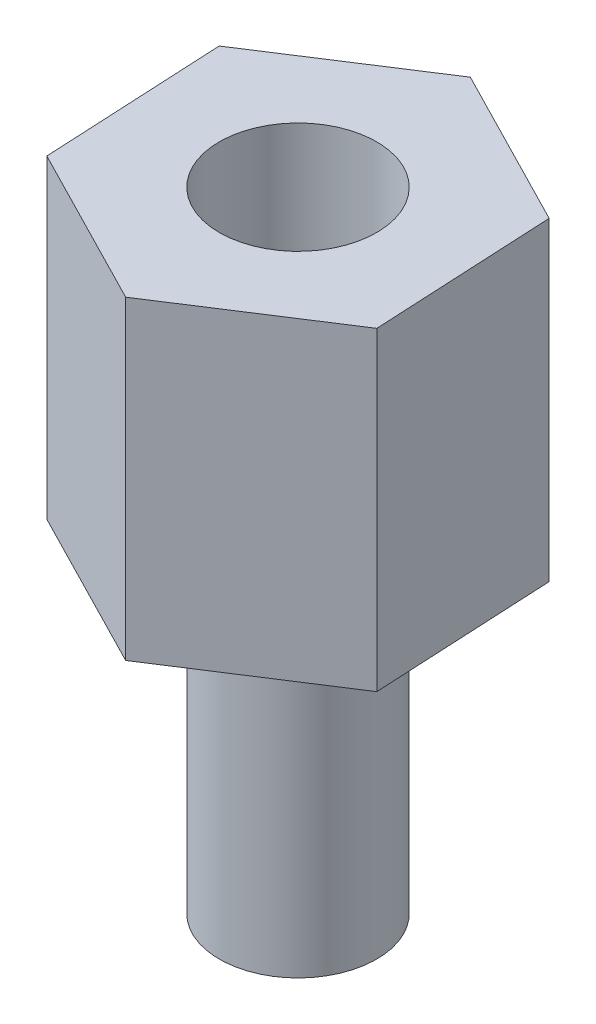
ISO-10303-21;
HEADER;
FILE_DESCRIPTION(('STEP AP214'),'2;1');
FILE_NAME('part.step','',(''),(''),'','','');
FILE_SCHEMA(('AUTOMOTIVE_DESIGN { 1 0 10303 214 1 1 1 1 }'));
ENDSEC;
DATA;
#1=APPLICATION_CONTEXT('core data for automotive mechanical design processes');
#2=APPLICATION_PROTOCOL_DEFINITION('international standard','automotive_design',2000,#1);
#3=PRODUCT_CONTEXT('',#1,'mechanical');
#4=PRODUCT('Part','Part','',(#3));
#5=PRODUCT_RELATED_PRODUCT_CATEGORY('part','',(#4));
#6=PRODUCT_DEFINITION_FORMATION('','',#4);
#7=PRODUCT_DEFINITION_CONTEXT('part definition',#1,'design');
#8=PRODUCT_DEFINITION('design','',#6,#7);
#9=PRODUCT_DEFINITION_SHAPE('','',#8);
#10=(LENGTH_UNIT() NAMED_UNIT(*) SI_UNIT(.MILLI.,.METRE.));
#11=(NAMED_UNIT(*) PLANE_ANGLE_UNIT() SI_UNIT($,.RADIAN.));
#12=(NAMED_UNIT(*) SI_UNIT($,.STERADIAN.) SOLID_ANGLE_UNIT());
#13=UNCERTAINTY_MEASURE_WITH_UNIT(LENGTH_MEASURE(1.E-05),#10,'distance_accuracy_value','');
#14=(GEOMETRIC_REPRESENTATION_CONTEXT(3) GLOBAL_UNCERTAINTY_ASSIGNED_CONTEXT((#13)) GLOBAL_UNIT_ASSIGNED_CONTEXT((#10,
#11,#12)) REPRESENTATION_CONTEXT('',''));
#15=CARTESIAN_POINT('',(0.,0.,0.));
#16=DIRECTION('',(0.,0.,1.));
#17=DIRECTION('',(1.,0.,0.));
#18=AXIS2_PLACEMENT_3D('',#15,#16,#17);
#19=CARTESIAN_POINT('',(2.56910375112783,0.,1.31644948603212));
#20=DIRECTION('',(0.,-1.,0.));
#21=DIRECTION('',(0.,0.,-1.));
#22=AXIS2_PLACEMENT_3D('',#19,#20,#21);
#23=PLANE('',#22);
#24=DIRECTION('',(-0.0500469768772833,0.,-0.998746864878907));
#25=VECTOR('',#24,1.);
#26=CARTESIAN_POINT('',(2.56910375112783,0.,1.31644948603212));
#27=LINE('',#26,#25);
#28=CARTESIAN_POINT('',(2.56910375112783,0.,1.31644948603212));
#29=VERTEX_POINT('',#28);
#30=CARTESIAN_POINT('',(2.4246305732667,0.,-1.56668437041854));
#31=VERTEX_POINT('',#30);
#32=EDGE_CURVE('E89',#29,#31,#27,.T.);
#33=ORIENTED_EDGE('',*,*,#32,.F.);
#34=DIRECTION('',(0.839916668496556,0.,-0.542715385797793));
#35=VECTOR('',#34,1.);
#36=CARTESIAN_POINT('',(0.144473177861132,0.,2.88313385645066));
#37=LINE('',#36,#35);
#38=CARTESIAN_POINT('',(0.144473177861132,0.,2.88313385645066));
#39=VERTEX_POINT('',#38);
#40=EDGE_CURVE('E115',#39,#29,#37,.T.);
#41=ORIENTED_EDGE('',*,*,#40,.F.);
#42=DIRECTION('',(0.889963645373839,0.,0.456031479081114));
#43=VECTOR('',#42,1.);
#44=CARTESIAN_POINT('',(-2.4246305732667,0.,1.56668437041854));
#45=LINE('',#44,#43);
#46=CARTESIAN_POINT('',(-2.4246305732667,0.,1.56668437041854));
#47=VERTEX_POINT('',#46);
#48=EDGE_CURVE('E113',#47,#39,#45,.T.);
#49=ORIENTED_EDGE('',*,*,#48,.F.);
#50=DIRECTION('',(0.0500469768772832,0.,0.998746864878907));
#51=VECTOR('',#50,1.);
#52=CARTESIAN_POINT('',(-2.56910375112783,0.,-1.31644948603212));
#53=LINE('',#52,#51);
#54=CARTESIAN_POINT('',(-2.56910375112783,0.,-1.31644948603212));
#55=VERTEX_POINT('',#54);
#56=EDGE_CURVE('E111',#55,#47,#53,.T.);
#57=ORIENTED_EDGE('',*,*,#56,.F.);
#58=DIRECTION('',(-0.839916668496555,0.,0.542715385797793));
#59=VECTOR('',#58,1.);
#60=CARTESIAN_POINT('',(-0.144473177861132,0.,-2.88313385645066));
#61=LINE('',#60,#59);
#62=CARTESIAN_POINT('',(-0.144473177861132,0.,-2.88313385645066));
#63=VERTEX_POINT('',#62);
#64=EDGE_CURVE('E91',#63,#55,#61,.T.);
#65=ORIENTED_EDGE('',*,*,#64,.F.);
#66=DIRECTION('',(-0.889963645373839,0.,-0.456031479081114));
#67=VECTOR('',#66,1.);
#68=CARTESIAN_POINT('',(2.4246305732667,0.,-1.56668437041854));
#69=LINE('',#68,#67);
#70=EDGE_CURVE('E85',#31,#63,#69,.T.);
#71=ORIENTED_EDGE('',*,*,#70,.F.);
#72=EDGE_LOOP('',(#33,#41,#49,#57,#65,#71));
#73=FACE_BOUND('',#72,.T.);
#74=CARTESIAN_POINT('',(0.,0.,0.));
#75=DIRECTION('',(0.,-1.,0.));
#76=DIRECTION('',(0.,0.,-1.));
#77=AXIS2_PLACEMENT_3D('',#74,#75,#76);
#78=CIRCLE('',#77,1.25);
#79=CARTESIAN_POINT('',(0.,0.,-1.25));
#80=VERTEX_POINT('',#79);
#81=EDGE_CURVE('E106',#80,#80,#78,.T.);
#82=ORIENTED_EDGE('',*,*,#81,.F.);
#83=EDGE_LOOP('',(#82));
#84=FACE_BOUND('',#83,.T.);
#85=ADVANCED_FACE('F32',(#73,#84),#23,.T.);
#86=CARTESIAN_POINT('',(2.56910375112783,5.,1.31644948603212));
#87=DIRECTION('',(-0.998746864878907,0.,0.0500469768772833));
#88=DIRECTION('',(0.0500469768772833,0.,0.998746864878907));
#89=AXIS2_PLACEMENT_3D('',#86,#87,#88);
#90=PLANE('',#89);
#91=ORIENTED_EDGE('',*,*,#32,.T.);
#92=DIRECTION('',(0.,-1.,0.));
#93=VECTOR('',#92,1.);
#94=CARTESIAN_POINT('',(2.4246305732667,5.,-1.56668437041854));
#95=LINE('',#94,#93);
#96=CARTESIAN_POINT('',(2.4246305732667,5.,-1.56668437041854));
#97=VERTEX_POINT('',#96);
#98=EDGE_CURVE('E11',#97,#31,#95,.T.);
#99=ORIENTED_EDGE('',*,*,#98,.F.);
#100=DIRECTION('',(-0.0500469768772833,0.,-0.998746864878907));
#101=VECTOR('',#100,1.);
#102=CARTESIAN_POINT('',(2.56910375112783,5.,1.31644948603212));
#103=LINE('',#102,#101);
#104=CARTESIAN_POINT('',(2.56910375112783,5.,1.31644948603212));
#105=VERTEX_POINT('',#104);
#106=EDGE_CURVE('E117',#105,#97,#103,.T.);
#107=ORIENTED_EDGE('',*,*,#106,.F.);
#108=DIRECTION('',(0.,-1.,0.));
#109=VECTOR('',#108,1.);
#110=CARTESIAN_POINT('',(2.56910375112783,5.,1.31644948603212));
#111=LINE('',#110,#109);
#112=EDGE_CURVE('E102',#105,#29,#111,.T.);
#113=ORIENTED_EDGE('',*,*,#112,.T.);
#114=EDGE_LOOP('',(#91,#99,#107,#113));
#115=FACE_BOUND('',#114,.T.);
#116=ADVANCED_FACE('F34',(#115),#90,.F.);
#117=CARTESIAN_POINT('',(2.4246305732667,5.,-1.56668437041854));
#118=DIRECTION('',(-0.456031479081114,0.,0.889963645373839));
#119=DIRECTION('',(0.889963645373839,0.,0.456031479081114));
#120=AXIS2_PLACEMENT_3D('',#117,#118,#119);
#121=PLANE('',#120);
#122=ORIENTED_EDGE('',*,*,#70,.T.);
#123=DIRECTION('',(0.,-1.,0.));
#124=VECTOR('',#123,1.);
#125=CARTESIAN_POINT('',(-0.144473177861132,5.,-2.88313385645066));
#126=LINE('',#125,#124);
#127=CARTESIAN_POINT('',(-0.144473177861132,5.,-2.88313385645066));
#128=VERTEX_POINT('',#127);
#129=EDGE_CURVE('E40',#128,#63,#126,.T.);
#130=ORIENTED_EDGE('',*,*,#129,.F.);
#131=DIRECTION('',(-0.889963645373839,0.,-0.456031479081114));
#132=VECTOR('',#131,1.);
#133=CARTESIAN_POINT('',(2.4246305732667,5.,-1.56668437041854));
#134=LINE('',#133,#132);
#135=EDGE_CURVE('E98',#97,#128,#134,.T.);
#136=ORIENTED_EDGE('',*,*,#135,.F.);
#137=ORIENTED_EDGE('',*,*,#98,.T.);
#138=EDGE_LOOP('',(#122,#130,#136,#137));
#139=FACE_BOUND('',#138,.T.);
#140=ADVANCED_FACE('F97',(#139),#121,.F.);
#141=CARTESIAN_POINT('',(-0.144473177861132,5.,-2.88313385645066));
#142=DIRECTION('',(0.542715385797793,0.,0.839916668496556));
#143=DIRECTION('',(0.839916668496556,0.,-0.542715385797793));
#144=AXIS2_PLACEMENT_3D('',#141,#142,#143);
#145=PLANE('',#144);
#146=ORIENTED_EDGE('',*,*,#64,.T.);
#147=DIRECTION('',(0.,-1.,0.));
#148=VECTOR('',#147,1.);
#149=CARTESIAN_POINT('',(-2.56910375112783,5.,-1.31644948603212));
#150=LINE('',#149,#148);
#151=CARTESIAN_POINT('',(-2.56910375112783,5.,-1.31644948603212));
#152=VERTEX_POINT('',#151);
#153=EDGE_CURVE('E133',#152,#55,#150,.T.);
#154=ORIENTED_EDGE('',*,*,#153,.F.);
#155=DIRECTION('',(-0.839916668496555,0.,0.542715385797793));
#156=VECTOR('',#155,1.);
#157=CARTESIAN_POINT('',(-0.144473177861132,5.,-2.88313385645066));
#158=LINE('',#157,#156);
#159=EDGE_CURVE('E120',#128,#152,#158,.T.);
#160=ORIENTED_EDGE('',*,*,#159,.F.);
#161=ORIENTED_EDGE('',*,*,#129,.T.);
#162=EDGE_LOOP('',(#146,#154,#160,#161));
#163=FACE_BOUND('',#162,.T.);
#164=ADVANCED_FACE('F137',(#163),#145,.F.);
#165=CARTESIAN_POINT('',(-2.56910375112783,5.,-1.31644948603212));
#166=DIRECTION('',(0.998746864878907,0.,-0.0500469768772832));
#167=DIRECTION('',(-0.0500469768772832,0.,-0.998746864878907));
#168=AXIS2_PLACEMENT_3D('',#165,#166,#167);
#169=PLANE('',#168);
#170=ORIENTED_EDGE('',*,*,#56,.T.);
#171=DIRECTION('',(0.,-1.,0.));
#172=VECTOR('',#171,1.);
#173=CARTESIAN_POINT('',(-2.4246305732667,5.,1.56668437041854));
#174=LINE('',#173,#172);
#175=CARTESIAN_POINT('',(-2.4246305732667,5.,1.56668437041854));
#176=VERTEX_POINT('',#175);
#177=EDGE_CURVE('E130',#176,#47,#174,.T.);
#178=ORIENTED_EDGE('',*,*,#177,.F.);
#179=DIRECTION('',(0.0500469768772832,0.,0.998746864878907));
#180=VECTOR('',#179,1.);
#181=CARTESIAN_POINT('',(-2.56910375112783,5.,-1.31644948603212));
#182=LINE('',#181,#180);
#183=EDGE_CURVE('E122',#152,#176,#182,.T.);
#184=ORIENTED_EDGE('',*,*,#183,.F.);
#185=ORIENTED_EDGE('',*,*,#153,.T.);
#186=EDGE_LOOP('',(#170,#178,#184,#185));
#187=FACE_BOUND('',#186,.T.);
#188=ADVANCED_FACE('F143',(#187),#169,.F.);
#189=CARTESIAN_POINT('',(-2.4246305732667,5.,1.56668437041854));
#190=DIRECTION('',(0.456031479081114,0.,-0.889963645373839));
#191=DIRECTION('',(-0.889963645373839,0.,-0.456031479081114));
#192=AXIS2_PLACEMENT_3D('',#189,#190,#191);
#193=PLANE('',#192);
#194=ORIENTED_EDGE('',*,*,#48,.T.);
#195=DIRECTION('',(0.,-1.,0.));
#196=VECTOR('',#195,1.);
#197=CARTESIAN_POINT('',(0.144473177861132,5.,2.88313385645066));
#198=LINE('',#197,#196);
#199=CARTESIAN_POINT('',(0.144473177861132,5.,2.88313385645066));
#200=VERTEX_POINT('',#199);
#201=EDGE_CURVE('E127',#200,#39,#198,.T.);
#202=ORIENTED_EDGE('',*,*,#201,.F.);
#203=DIRECTION('',(0.889963645373839,0.,0.456031479081114));
#204=VECTOR('',#203,1.);
#205=CARTESIAN_POINT('',(-2.4246305732667,5.,1.56668437041854));
#206=LINE('',#205,#204);
#207=EDGE_CURVE('E52',#176,#200,#206,.T.);
#208=ORIENTED_EDGE('',*,*,#207,.F.);
#209=ORIENTED_EDGE('',*,*,#177,.T.);
#210=EDGE_LOOP('',(#194,#202,#208,#209));
#211=FACE_BOUND('',#210,.T.);
#212=ADVANCED_FACE('F146',(#211),#193,.F.);
#213=CARTESIAN_POINT('',(0.144473177861132,5.,2.88313385645066));
#214=DIRECTION('',(-0.542715385797793,0.,-0.839916668496556));
#215=DIRECTION('',(-0.839916668496556,0.,0.542715385797793));
#216=AXIS2_PLACEMENT_3D('',#213,#214,#215);
#217=PLANE('',#216);
#218=ORIENTED_EDGE('',*,*,#40,.T.);
#219=ORIENTED_EDGE('',*,*,#112,.F.);
#220=DIRECTION('',(0.839916668496556,0.,-0.542715385797793));
#221=VECTOR('',#220,1.);
#222=CARTESIAN_POINT('',(0.144473177861132,5.,2.88313385645066));
#223=LINE('',#222,#221);
#224=EDGE_CURVE('E47',#200,#105,#223,.T.);
#225=ORIENTED_EDGE('',*,*,#224,.F.);
#226=ORIENTED_EDGE('',*,*,#201,.T.);
#227=EDGE_LOOP('',(#218,#219,#225,#226));
#228=FACE_BOUND('',#227,.T.);
#229=ADVANCED_FACE('F148',(#228),#217,.F.);
#230=CARTESIAN_POINT('',(2.56910375112783,5.,1.31644948603212));
#231=DIRECTION('',(0.,-1.,0.));
#232=DIRECTION('',(0.,0.,-1.));
#233=AXIS2_PLACEMENT_3D('',#230,#231,#232);
#234=PLANE('',#233);
#235=CARTESIAN_POINT('',(0.,5.,0.));
#236=DIRECTION('',(0.,1.,0.));
#237=DIRECTION('',(0.,0.,1.));
#238=AXIS2_PLACEMENT_3D('',#235,#236,#237);
#239=CIRCLE('',#238,1.25);
#240=CARTESIAN_POINT('',(0.,5.,1.25));
#241=VERTEX_POINT('',#240);
#242=EDGE_CURVE('E184',#241,#241,#239,.T.);
#243=ORIENTED_EDGE('',*,*,#242,.F.);
#244=EDGE_LOOP('',(#243));
#245=FACE_BOUND('',#244,.T.);
#246=ORIENTED_EDGE('',*,*,#106,.T.);
#247=ORIENTED_EDGE('',*,*,#135,.T.);
#248=ORIENTED_EDGE('',*,*,#159,.T.);
#249=ORIENTED_EDGE('',*,*,#183,.T.);
#250=ORIENTED_EDGE('',*,*,#207,.T.);
#251=ORIENTED_EDGE('',*,*,#224,.T.);
#252=EDGE_LOOP('',(#246,#247,#248,#249,#250,#251));
#253=FACE_BOUND('',#252,.T.);
#254=ADVANCED_FACE('F140',(#245,#253),#234,.F.);
#255=CARTESIAN_POINT('',(0.,-5.,0.));
#256=DIRECTION('',(0.,1.,0.));
#257=DIRECTION('',(0.,0.,1.));
#258=AXIS2_PLACEMENT_3D('',#255,#256,#257);
#259=CYLINDRICAL_SURFACE('',#258,1.25);
#260=CARTESIAN_POINT('',(0.,-5.,0.));
#261=DIRECTION('',(0.,-1.,0.));
#262=DIRECTION('',(0.,0.,-1.));
#263=AXIS2_PLACEMENT_3D('',#260,#261,#262);
#264=CIRCLE('',#263,1.25);
#265=CARTESIAN_POINT('',(0.,-5.,-1.25));
#266=VERTEX_POINT('',#265);
#267=EDGE_CURVE('E103',#266,#266,#264,.T.);
#268=ORIENTED_EDGE('',*,*,#267,.F.);
#269=EDGE_LOOP('',(#268));
#270=FACE_BOUND('',#269,.T.);
#271=ORIENTED_EDGE('',*,*,#81,.T.);
#272=EDGE_LOOP('',(#271));
#273=FACE_BOUND('',#272,.T.);
#274=ADVANCED_FACE('F155',(#270,#273),#259,.T.);
#275=CARTESIAN_POINT('',(0.,-5.,0.));
#276=DIRECTION('',(0.,-1.,0.));
#277=DIRECTION('',(0.,0.,-1.));
#278=AXIS2_PLACEMENT_3D('',#275,#276,#277);
#279=PLANE('',#278);
#280=ORIENTED_EDGE('',*,*,#267,.T.);
#281=EDGE_LOOP('',(#280));
#282=FACE_BOUND('',#281,.T.);
#283=ADVANCED_FACE('F167',(#282),#279,.T.);
#284=CARTESIAN_POINT('',(0.,1.,0.));
#285=DIRECTION('',(0.,1.,0.));
#286=DIRECTION('',(0.,0.,1.));
#287=AXIS2_PLACEMENT_3D('',#284,#285,#286);
#288=CYLINDRICAL_SURFACE('',#287,1.25);
#289=CARTESIAN_POINT('',(0.,1.,0.));
#290=DIRECTION('',(0.,1.,0.));
#291=DIRECTION('',(0.,0.,1.));
#292=AXIS2_PLACEMENT_3D('',#289,#290,#291);
#293=CIRCLE('',#292,1.25);
#294=CARTESIAN_POINT('',(0.,1.,1.25));
#295=VERTEX_POINT('',#294);
#296=EDGE_CURVE('E183',#295,#295,#293,.T.);
#297=ORIENTED_EDGE('',*,*,#296,.F.);
#298=EDGE_LOOP('',(#297));
#299=FACE_BOUND('',#298,.T.);
#300=ORIENTED_EDGE('',*,*,#242,.T.);
#301=EDGE_LOOP('',(#300));
#302=FACE_BOUND('',#301,.T.);
#303=ADVANCED_FACE('F171',(#299,#302),#288,.F.);
#304=CARTESIAN_POINT('',(0.,1.,0.));
#305=DIRECTION('',(0.,1.,0.));
#306=DIRECTION('',(0.,0.,1.));
#307=AXIS2_PLACEMENT_3D('',#304,#305,#306);
#308=PLANE('',#307);
#309=ORIENTED_EDGE('',*,*,#296,.T.);
#310=EDGE_LOOP('',(#309));
#311=FACE_BOUND('',#310,.T.);
#312=ADVANCED_FACE('F175',(#311),#308,.T.);
#313=CLOSED_SHELL('',(#85,#116,#140,#164,#188,#212,#229,#254,#274,#283,#303,#312));
#314=MANIFOLD_SOLID_BREP('B2',#313);
#315=ADVANCED_BREP_SHAPE_REPRESENTATION('',(#18,#314),#14);
#316=SHAPE_DEFINITION_REPRESENTATION(#9,#315);
ENDSEC;
END-ISO-10303-21;
